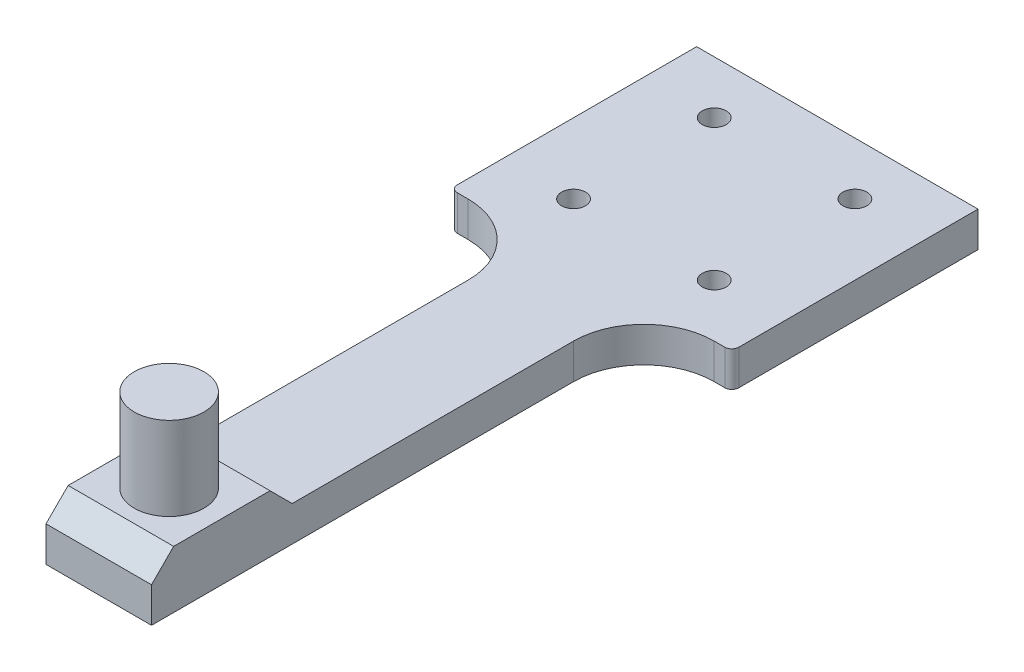
ISO-10303-21;
HEADER;
FILE_DESCRIPTION(('STEP AP214'),'2;1');
FILE_NAME('part.step','',(''),(''),'','','');
FILE_SCHEMA(('AUTOMOTIVE_DESIGN { 1 0 10303 214 1 1 1 1 }'));
ENDSEC;
DATA;
#1=APPLICATION_CONTEXT('core data for automotive mechanical design processes');
#2=APPLICATION_PROTOCOL_DEFINITION('international standard','automotive_design',2000,#1);
#3=PRODUCT_CONTEXT('',#1,'mechanical');
#4=PRODUCT('Part','Part','',(#3));
#5=PRODUCT_RELATED_PRODUCT_CATEGORY('part','',(#4));
#6=PRODUCT_DEFINITION_FORMATION('','',#4);
#7=PRODUCT_DEFINITION_CONTEXT('part definition',#1,'design');
#8=PRODUCT_DEFINITION('design','',#6,#7);
#9=PRODUCT_DEFINITION_SHAPE('','',#8);
#10=(LENGTH_UNIT() NAMED_UNIT(*) SI_UNIT(.MILLI.,.METRE.));
#11=(NAMED_UNIT(*) PLANE_ANGLE_UNIT() SI_UNIT($,.RADIAN.));
#12=(NAMED_UNIT(*) SI_UNIT($,.STERADIAN.) SOLID_ANGLE_UNIT());
#13=UNCERTAINTY_MEASURE_WITH_UNIT(LENGTH_MEASURE(1.E-05),#10,'distance_accuracy_value','');
#14=(GEOMETRIC_REPRESENTATION_CONTEXT(3) GLOBAL_UNCERTAINTY_ASSIGNED_CONTEXT((#13)) GLOBAL_UNIT_ASSIGNED_CONTEXT((#10,
#11,#12)) REPRESENTATION_CONTEXT('',''));
#15=CARTESIAN_POINT('',(0.,0.,0.));
#16=DIRECTION('',(0.,0.,1.));
#17=DIRECTION('',(1.,0.,0.));
#18=AXIS2_PLACEMENT_3D('',#15,#16,#17);
#19=CARTESIAN_POINT('',(0.,5.,0.));
#20=DIRECTION('',(0.,1.,0.));
#21=DIRECTION('',(0.,0.,1.));
#22=AXIS2_PLACEMENT_3D('',#19,#20,#21);
#23=PLANE('',#22);
#24=CARTESIAN_POINT('',(10.,5.,-10.));
#25=DIRECTION('',(0.,1.,0.));
#26=DIRECTION('',(0.,0.,1.));
#27=AXIS2_PLACEMENT_3D('',#24,#25,#26);
#28=CIRCLE('',#27,1.7);
#29=CARTESIAN_POINT('',(10.,5.,-8.3));
#30=VERTEX_POINT('',#29);
#31=EDGE_CURVE('E205',#30,#30,#28,.T.);
#32=ORIENTED_EDGE('',*,*,#31,.F.);
#33=EDGE_LOOP('',(#32));
#34=FACE_BOUND('',#33,.T.);
#35=CARTESIAN_POINT('',(-10.,5.,10.));
#36=DIRECTION('',(0.,1.,0.));
#37=DIRECTION('',(0.,0.,1.));
#38=AXIS2_PLACEMENT_3D('',#35,#36,#37);
#39=CIRCLE('',#38,1.7);
#40=CARTESIAN_POINT('',(-10.,5.,11.7));
#41=VERTEX_POINT('',#40);
#42=EDGE_CURVE('E199',#41,#41,#39,.T.);
#43=ORIENTED_EDGE('',*,*,#42,.F.);
#44=EDGE_LOOP('',(#43));
#45=FACE_BOUND('',#44,.T.);
#46=CARTESIAN_POINT('',(-10.,5.,-10.));
#47=DIRECTION('',(0.,1.,0.));
#48=DIRECTION('',(0.,0.,1.));
#49=AXIS2_PLACEMENT_3D('',#46,#47,#48);
#50=CIRCLE('',#49,1.7);
#51=CARTESIAN_POINT('',(-10.,5.,-8.3));
#52=VERTEX_POINT('',#51);
#53=EDGE_CURVE('E193',#52,#52,#50,.T.);
#54=ORIENTED_EDGE('',*,*,#53,.F.);
#55=EDGE_LOOP('',(#54));
#56=FACE_BOUND('',#55,.T.);
#57=CARTESIAN_POINT('',(10.,5.,10.));
#58=DIRECTION('',(0.,1.,0.));
#59=DIRECTION('',(0.,0.,1.));
#60=AXIS2_PLACEMENT_3D('',#57,#58,#59);
#61=CIRCLE('',#60,1.7);
#62=CARTESIAN_POINT('',(10.,5.,11.7));
#63=VERTEX_POINT('',#62);
#64=EDGE_CURVE('E186',#63,#63,#61,.T.);
#65=ORIENTED_EDGE('',*,*,#64,.F.);
#66=EDGE_LOOP('',(#65));
#67=FACE_BOUND('',#66,.T.);
#68=DIRECTION('',(0.,0.,1.));
#69=VECTOR('',#68,1.);
#70=CARTESIAN_POINT('',(-7.5,5.,17.5));
#71=LINE('',#70,#69);
#72=CARTESIAN_POINT('',(-7.5,5.,27.5));
#73=VERTEX_POINT('',#72);
#74=CARTESIAN_POINT('',(-7.50000000000001,5.,67.5));
#75=VERTEX_POINT('',#74);
#76=EDGE_CURVE('E180',#73,#75,#71,.T.);
#77=ORIENTED_EDGE('',*,*,#76,.T.);
#78=DIRECTION('',(1.,0.,0.));
#79=VECTOR('',#78,1.);
#80=CARTESIAN_POINT('',(0.,5.,67.5));
#81=LINE('',#80,#79);
#82=CARTESIAN_POINT('',(7.50000000000001,5.,67.5));
#83=VERTEX_POINT('',#82);
#84=EDGE_CURVE('E275',#75,#83,#81,.T.);
#85=ORIENTED_EDGE('',*,*,#84,.T.);
#86=DIRECTION('',(0.,0.,-1.));
#87=VECTOR('',#86,1.);
#88=CARTESIAN_POINT('',(7.5,5.,17.5));
#89=LINE('',#88,#87);
#90=CARTESIAN_POINT('',(7.5,5.,27.5));
#91=VERTEX_POINT('',#90);
#92=EDGE_CURVE('E161',#83,#91,#89,.T.);
#93=ORIENTED_EDGE('',*,*,#92,.T.);
#94=CARTESIAN_POINT('',(17.5,5.,27.5));
#95=DIRECTION('',(0.,1.,0.));
#96=DIRECTION('',(0.,0.,1.));
#97=AXIS2_PLACEMENT_3D('',#94,#95,#96);
#98=CIRCLE('',#97,10.);
#99=CARTESIAN_POINT('',(17.5,5.,17.5));
#100=VERTEX_POINT('',#99);
#101=EDGE_CURVE('E249',#91,#100,#98,.F.);
#102=ORIENTED_EDGE('',*,*,#101,.T.);
#103=DIRECTION('',(1.,0.,0.));
#104=VECTOR('',#103,1.);
#105=CARTESIAN_POINT('',(-20.,5.,17.5));
#106=LINE('',#105,#104);
#107=CARTESIAN_POINT('',(19.,5.,17.5));
#108=VERTEX_POINT('',#107);
#109=EDGE_CURVE('E220',#100,#108,#106,.T.);
#110=ORIENTED_EDGE('',*,*,#109,.T.);
#111=CARTESIAN_POINT('',(19.,5.,16.5));
#112=DIRECTION('',(0.,1.,0.));
#113=DIRECTION('',(0.,0.,1.));
#114=AXIS2_PLACEMENT_3D('',#111,#112,#113);
#115=CIRCLE('',#114,1.);
#116=CARTESIAN_POINT('',(20.,5.,16.5));
#117=VERTEX_POINT('',#116);
#118=EDGE_CURVE('E268',#108,#117,#115,.T.);
#119=ORIENTED_EDGE('',*,*,#118,.T.);
#120=DIRECTION('',(0.,0.,-1.));
#121=VECTOR('',#120,1.);
#122=CARTESIAN_POINT('',(20.,5.,-17.5));
#123=LINE('',#122,#121);
#124=CARTESIAN_POINT('',(20.,5.,-17.5));
#125=VERTEX_POINT('',#124);
#126=EDGE_CURVE('E212',#117,#125,#123,.T.);
#127=ORIENTED_EDGE('',*,*,#126,.T.);
#128=DIRECTION('',(-1.,0.,0.));
#129=VECTOR('',#128,1.);
#130=CARTESIAN_POINT('',(-20.,5.,-17.5));
#131=LINE('',#130,#129);
#132=CARTESIAN_POINT('',(-20.,5.,-17.5));
#133=VERTEX_POINT('',#132);
#134=EDGE_CURVE('E214',#125,#133,#131,.T.);
#135=ORIENTED_EDGE('',*,*,#134,.T.);
#136=DIRECTION('',(0.,0.,1.));
#137=VECTOR('',#136,1.);
#138=CARTESIAN_POINT('',(-20.,5.,-17.5));
#139=LINE('',#138,#137);
#140=CARTESIAN_POINT('',(-20.,5.,16.5));
#141=VERTEX_POINT('',#140);
#142=EDGE_CURVE('E217',#133,#141,#139,.T.);
#143=ORIENTED_EDGE('',*,*,#142,.T.);
#144=CARTESIAN_POINT('',(-19.,5.,16.5));
#145=DIRECTION('',(0.,1.,0.));
#146=DIRECTION('',(0.,0.,1.));
#147=AXIS2_PLACEMENT_3D('',#144,#145,#146);
#148=CIRCLE('',#147,1.);
#149=CARTESIAN_POINT('',(-19.,5.,17.5));
#150=VERTEX_POINT('',#149);
#151=EDGE_CURVE('E266',#141,#150,#148,.T.);
#152=ORIENTED_EDGE('',*,*,#151,.T.);
#153=CARTESIAN_POINT('',(-17.5,5.,17.5));
#154=VERTEX_POINT('',#153);
#155=EDGE_CURVE('E221',#150,#154,#106,.T.);
#156=ORIENTED_EDGE('',*,*,#155,.T.);
#157=CARTESIAN_POINT('',(-17.5,5.,27.5));
#158=DIRECTION('',(0.,1.,0.));
#159=DIRECTION('',(0.,0.,1.));
#160=AXIS2_PLACEMENT_3D('',#157,#158,#159);
#161=CIRCLE('',#160,10.);
#162=EDGE_CURVE('E253',#154,#73,#161,.F.);
#163=ORIENTED_EDGE('',*,*,#162,.T.);
#164=EDGE_LOOP('',(#77,#85,#93,#102,#110,#119,#127,#135,#143,#152,#156,#163));
#165=FACE_BOUND('',#164,.T.);
#166=ADVANCED_FACE('F41',(#34,#45,#56,#67,#165),#23,.T.);
#167=CARTESIAN_POINT('',(-20.,5.,17.5));
#168=DIRECTION('',(0.,0.,-1.));
#169=DIRECTION('',(-1.,0.,0.));
#170=AXIS2_PLACEMENT_3D('',#167,#168,#169);
#171=PLANE('',#170);
#172=DIRECTION('',(1.,0.,0.));
#173=VECTOR('',#172,1.);
#174=CARTESIAN_POINT('',(-20.,0.,17.5));
#175=LINE('',#174,#173);
#176=CARTESIAN_POINT('',(17.5,0.,17.5));
#177=VERTEX_POINT('',#176);
#178=CARTESIAN_POINT('',(19.,0.,17.5));
#179=VERTEX_POINT('',#178);
#180=EDGE_CURVE('E230',#177,#179,#175,.T.);
#181=ORIENTED_EDGE('',*,*,#180,.T.);
#182=DIRECTION('',(0.,-1.,0.));
#183=VECTOR('',#182,1.);
#184=CARTESIAN_POINT('',(19.,5.,17.5));
#185=LINE('',#184,#183);
#186=EDGE_CURVE('E264',#179,#108,#185,.F.);
#187=ORIENTED_EDGE('',*,*,#186,.T.);
#188=ORIENTED_EDGE('',*,*,#109,.F.);
#189=DIRECTION('',(0.,1.,0.));
#190=VECTOR('',#189,1.);
#191=CARTESIAN_POINT('',(17.5,5.,17.5));
#192=LINE('',#191,#190);
#193=EDGE_CURVE('E243',#100,#177,#192,.F.);
#194=ORIENTED_EDGE('',*,*,#193,.T.);
#195=EDGE_LOOP('',(#181,#187,#188,#194));
#196=FACE_BOUND('',#195,.T.);
#197=ADVANCED_FACE('F309',(#196),#171,.F.);
#198=CARTESIAN_POINT('',(20.,5.,-17.5));
#199=DIRECTION('',(-1.,0.,0.));
#200=DIRECTION('',(0.,0.,1.));
#201=AXIS2_PLACEMENT_3D('',#198,#199,#200);
#202=PLANE('',#201);
#203=ORIENTED_EDGE('',*,*,#126,.F.);
#204=DIRECTION('',(0.,-1.,0.));
#205=VECTOR('',#204,1.);
#206=CARTESIAN_POINT('',(20.,5.,16.5));
#207=LINE('',#206,#205);
#208=CARTESIAN_POINT('',(20.,0.,16.5));
#209=VERTEX_POINT('',#208);
#210=EDGE_CURVE('E257',#117,#209,#207,.T.);
#211=ORIENTED_EDGE('',*,*,#210,.T.);
#212=DIRECTION('',(0.,0.,-1.));
#213=VECTOR('',#212,1.);
#214=CARTESIAN_POINT('',(20.,0.,-17.5));
#215=LINE('',#214,#213);
#216=CARTESIAN_POINT('',(20.,0.,-17.5));
#217=VERTEX_POINT('',#216);
#218=EDGE_CURVE('E211',#209,#217,#215,.T.);
#219=ORIENTED_EDGE('',*,*,#218,.T.);
#220=DIRECTION('',(0.,-1.,0.));
#221=VECTOR('',#220,1.);
#222=CARTESIAN_POINT('',(20.,5.,-17.5));
#223=LINE('',#222,#221);
#224=EDGE_CURVE('E234',#125,#217,#223,.T.);
#225=ORIENTED_EDGE('',*,*,#224,.F.);
#226=EDGE_LOOP('',(#203,#211,#219,#225));
#227=FACE_BOUND('',#226,.T.);
#228=ADVANCED_FACE('F319',(#227),#202,.F.);
#229=CARTESIAN_POINT('',(-20.,5.,-17.5));
#230=DIRECTION('',(0.,0.,1.));
#231=DIRECTION('',(1.,0.,0.));
#232=AXIS2_PLACEMENT_3D('',#229,#230,#231);
#233=PLANE('',#232);
#234=DIRECTION('',(-1.,0.,0.));
#235=VECTOR('',#234,1.);
#236=CARTESIAN_POINT('',(-20.,0.,-17.5));
#237=LINE('',#236,#235);
#238=CARTESIAN_POINT('',(-20.,0.,-17.5));
#239=VERTEX_POINT('',#238);
#240=EDGE_CURVE('E225',#217,#239,#237,.T.);
#241=ORIENTED_EDGE('',*,*,#240,.T.);
#242=DIRECTION('',(0.,-1.,0.));
#243=VECTOR('',#242,1.);
#244=CARTESIAN_POINT('',(-20.,5.,-17.5));
#245=LINE('',#244,#243);
#246=EDGE_CURVE('E223',#133,#239,#245,.T.);
#247=ORIENTED_EDGE('',*,*,#246,.F.);
#248=ORIENTED_EDGE('',*,*,#134,.F.);
#249=ORIENTED_EDGE('',*,*,#224,.T.);
#250=EDGE_LOOP('',(#241,#247,#248,#249));
#251=FACE_BOUND('',#250,.T.);
#252=ADVANCED_FACE('F322',(#251),#233,.F.);
#253=CARTESIAN_POINT('',(-20.,5.,-17.5));
#254=DIRECTION('',(1.,0.,0.));
#255=DIRECTION('',(0.,0.,-1.));
#256=AXIS2_PLACEMENT_3D('',#253,#254,#255);
#257=PLANE('',#256);
#258=DIRECTION('',(0.,0.,1.));
#259=VECTOR('',#258,1.);
#260=CARTESIAN_POINT('',(-20.,0.,-17.5));
#261=LINE('',#260,#259);
#262=CARTESIAN_POINT('',(-20.,0.,16.5));
#263=VERTEX_POINT('',#262);
#264=EDGE_CURVE('E227',#239,#263,#261,.T.);
#265=ORIENTED_EDGE('',*,*,#264,.T.);
#266=DIRECTION('',(0.,-1.,0.));
#267=VECTOR('',#266,1.);
#268=CARTESIAN_POINT('',(-20.,5.,16.5));
#269=LINE('',#268,#267);
#270=EDGE_CURVE('E273',#263,#141,#269,.F.);
#271=ORIENTED_EDGE('',*,*,#270,.T.);
#272=ORIENTED_EDGE('',*,*,#142,.F.);
#273=ORIENTED_EDGE('',*,*,#246,.T.);
#274=EDGE_LOOP('',(#265,#271,#272,#273));
#275=FACE_BOUND('',#274,.T.);
#276=ADVANCED_FACE('F368',(#275),#257,.F.);
#277=ORIENTED_EDGE('',*,*,#155,.F.);
#278=DIRECTION('',(0.,-1.,0.));
#279=VECTOR('',#278,1.);
#280=CARTESIAN_POINT('',(-19.,5.,17.5));
#281=LINE('',#280,#279);
#282=CARTESIAN_POINT('',(-19.,0.,17.5));
#283=VERTEX_POINT('',#282);
#284=EDGE_CURVE('E270',#150,#283,#281,.T.);
#285=ORIENTED_EDGE('',*,*,#284,.T.);
#286=CARTESIAN_POINT('',(-17.5,0.,17.5));
#287=VERTEX_POINT('',#286);
#288=EDGE_CURVE('E215',#283,#287,#175,.T.);
#289=ORIENTED_EDGE('',*,*,#288,.T.);
#290=DIRECTION('',(0.,1.,0.));
#291=VECTOR('',#290,1.);
#292=CARTESIAN_POINT('',(-17.5,5.,17.5));
#293=LINE('',#292,#291);
#294=EDGE_CURVE('E245',#287,#154,#293,.T.);
#295=ORIENTED_EDGE('',*,*,#294,.T.);
#296=EDGE_LOOP('',(#277,#285,#289,#295));
#297=FACE_BOUND('',#296,.T.);
#298=ADVANCED_FACE('F334',(#297),#171,.F.);
#299=CARTESIAN_POINT('',(0.,0.,0.));
#300=DIRECTION('',(0.,1.,0.));
#301=DIRECTION('',(0.,0.,1.));
#302=AXIS2_PLACEMENT_3D('',#299,#300,#301);
#303=PLANE('',#302);
#304=CARTESIAN_POINT('',(10.,0.,10.));
#305=DIRECTION('',(0.,1.,0.));
#306=DIRECTION('',(0.,0.,1.));
#307=AXIS2_PLACEMENT_3D('',#304,#305,#306);
#308=CIRCLE('',#307,1.7);
#309=CARTESIAN_POINT('',(10.,0.,11.7));
#310=VERTEX_POINT('',#309);
#311=EDGE_CURVE('E190',#310,#310,#308,.T.);
#312=ORIENTED_EDGE('',*,*,#311,.T.);
#313=EDGE_LOOP('',(#312));
#314=FACE_BOUND('',#313,.T.);
#315=CARTESIAN_POINT('',(-10.,0.,-10.));
#316=DIRECTION('',(0.,1.,0.));
#317=DIRECTION('',(0.,0.,1.));
#318=AXIS2_PLACEMENT_3D('',#315,#316,#317);
#319=CIRCLE('',#318,1.7);
#320=CARTESIAN_POINT('',(-10.,0.,-8.3));
#321=VERTEX_POINT('',#320);
#322=EDGE_CURVE('E196',#321,#321,#319,.T.);
#323=ORIENTED_EDGE('',*,*,#322,.T.);
#324=EDGE_LOOP('',(#323));
#325=FACE_BOUND('',#324,.T.);
#326=CARTESIAN_POINT('',(-10.,0.,10.));
#327=DIRECTION('',(0.,1.,0.));
#328=DIRECTION('',(0.,0.,1.));
#329=AXIS2_PLACEMENT_3D('',#326,#327,#328);
#330=CIRCLE('',#329,1.7);
#331=CARTESIAN_POINT('',(-10.,0.,11.7));
#332=VERTEX_POINT('',#331);
#333=EDGE_CURVE('E202',#332,#332,#330,.T.);
#334=ORIENTED_EDGE('',*,*,#333,.T.);
#335=EDGE_LOOP('',(#334));
#336=FACE_BOUND('',#335,.T.);
#337=CARTESIAN_POINT('',(10.,0.,-10.));
#338=DIRECTION('',(0.,1.,0.));
#339=DIRECTION('',(0.,0.,1.));
#340=AXIS2_PLACEMENT_3D('',#337,#338,#339);
#341=CIRCLE('',#340,1.7);
#342=CARTESIAN_POINT('',(10.,0.,-8.3));
#343=VERTEX_POINT('',#342);
#344=EDGE_CURVE('E208',#343,#343,#341,.T.);
#345=ORIENTED_EDGE('',*,*,#344,.T.);
#346=EDGE_LOOP('',(#345));
#347=FACE_BOUND('',#346,.T.);
#348=ORIENTED_EDGE('',*,*,#218,.F.);
#349=CARTESIAN_POINT('',(19.,0.,16.5));
#350=DIRECTION('',(0.,1.,0.));
#351=DIRECTION('',(0.,0.,1.));
#352=AXIS2_PLACEMENT_3D('',#349,#350,#351);
#353=CIRCLE('',#352,1.);
#354=EDGE_CURVE('E262',#209,#179,#353,.F.);
#355=ORIENTED_EDGE('',*,*,#354,.T.);
#356=ORIENTED_EDGE('',*,*,#180,.F.);
#357=CARTESIAN_POINT('',(17.5,0.,27.5));
#358=DIRECTION('',(0.,1.,0.));
#359=DIRECTION('',(0.,0.,1.));
#360=AXIS2_PLACEMENT_3D('',#357,#358,#359);
#361=CIRCLE('',#360,10.);
#362=CARTESIAN_POINT('',(7.5,0.,27.5));
#363=VERTEX_POINT('',#362);
#364=EDGE_CURVE('E251',#177,#363,#361,.T.);
#365=ORIENTED_EDGE('',*,*,#364,.T.);
#366=DIRECTION('',(0.,0.,-1.));
#367=VECTOR('',#366,1.);
#368=CARTESIAN_POINT('',(7.5,0.,17.5));
#369=LINE('',#368,#367);
#370=CARTESIAN_POINT('',(7.50000000000001,0.,87.5));
#371=VERTEX_POINT('',#370);
#372=EDGE_CURVE('E170',#371,#363,#369,.T.);
#373=ORIENTED_EDGE('',*,*,#372,.F.);
#374=DIRECTION('',(1.,0.,0.));
#375=VECTOR('',#374,1.);
#376=CARTESIAN_POINT('',(-7.50000000000001,0.,87.5));
#377=LINE('',#376,#375);
#378=CARTESIAN_POINT('',(-7.50000000000001,0.,87.5));
#379=VERTEX_POINT('',#378);
#380=EDGE_CURVE('E160',#379,#371,#377,.T.);
#381=ORIENTED_EDGE('',*,*,#380,.F.);
#382=DIRECTION('',(0.,0.,1.));
#383=VECTOR('',#382,1.);
#384=CARTESIAN_POINT('',(-7.5,0.,17.5));
#385=LINE('',#384,#383);
#386=CARTESIAN_POINT('',(-7.5,0.,27.5));
#387=VERTEX_POINT('',#386);
#388=EDGE_CURVE('E148',#387,#379,#385,.T.);
#389=ORIENTED_EDGE('',*,*,#388,.F.);
#390=CARTESIAN_POINT('',(-17.5,0.,27.5));
#391=DIRECTION('',(0.,1.,0.));
#392=DIRECTION('',(0.,0.,1.));
#393=AXIS2_PLACEMENT_3D('',#390,#391,#392);
#394=CIRCLE('',#393,10.);
#395=EDGE_CURVE('E255',#387,#287,#394,.T.);
#396=ORIENTED_EDGE('',*,*,#395,.T.);
#397=ORIENTED_EDGE('',*,*,#288,.F.);
#398=CARTESIAN_POINT('',(-19.,0.,16.5));
#399=DIRECTION('',(0.,1.,0.));
#400=DIRECTION('',(0.,0.,1.));
#401=AXIS2_PLACEMENT_3D('',#398,#399,#400);
#402=CIRCLE('',#401,1.);
#403=EDGE_CURVE('E260',#283,#263,#402,.F.);
#404=ORIENTED_EDGE('',*,*,#403,.T.);
#405=ORIENTED_EDGE('',*,*,#264,.F.);
#406=ORIENTED_EDGE('',*,*,#240,.F.);
#407=EDGE_LOOP('',(#348,#355,#356,#365,#373,#381,#389,#396,#397,#404,#405,#406));
#408=FACE_BOUND('',#407,.T.);
#409=ADVANCED_FACE('F174',(#314,#325,#336,#347,#408),#303,.F.);
#410=CARTESIAN_POINT('',(10.,5.,-10.));
#411=DIRECTION('',(0.,1.,0.));
#412=DIRECTION('',(0.,0.,1.));
#413=AXIS2_PLACEMENT_3D('',#410,#411,#412);
#414=CYLINDRICAL_SURFACE('',#413,1.7);
#415=ORIENTED_EDGE('',*,*,#344,.F.);
#416=EDGE_LOOP('',(#415));
#417=FACE_BOUND('',#416,.T.);
#418=ORIENTED_EDGE('',*,*,#31,.T.);
#419=EDGE_LOOP('',(#418));
#420=FACE_BOUND('',#419,.T.);
#421=ADVANCED_FACE('F362',(#417,#420),#414,.F.);
#422=CARTESIAN_POINT('',(-10.,5.,10.));
#423=DIRECTION('',(0.,1.,0.));
#424=DIRECTION('',(0.,0.,1.));
#425=AXIS2_PLACEMENT_3D('',#422,#423,#424);
#426=CYLINDRICAL_SURFACE('',#425,1.7);
#427=ORIENTED_EDGE('',*,*,#333,.F.);
#428=EDGE_LOOP('',(#427));
#429=FACE_BOUND('',#428,.T.);
#430=ORIENTED_EDGE('',*,*,#42,.T.);
#431=EDGE_LOOP('',(#430));
#432=FACE_BOUND('',#431,.T.);
#433=ADVANCED_FACE('F503',(#429,#432),#426,.F.);
#434=CARTESIAN_POINT('',(-10.,5.,-10.));
#435=DIRECTION('',(0.,1.,0.));
#436=DIRECTION('',(0.,0.,1.));
#437=AXIS2_PLACEMENT_3D('',#434,#435,#436);
#438=CYLINDRICAL_SURFACE('',#437,1.7);
#439=ORIENTED_EDGE('',*,*,#322,.F.);
#440=EDGE_LOOP('',(#439));
#441=FACE_BOUND('',#440,.T.);
#442=ORIENTED_EDGE('',*,*,#53,.T.);
#443=EDGE_LOOP('',(#442));
#444=FACE_BOUND('',#443,.T.);
#445=ADVANCED_FACE('F494',(#441,#444),#438,.F.);
#446=CARTESIAN_POINT('',(10.,5.,10.));
#447=DIRECTION('',(0.,1.,0.));
#448=DIRECTION('',(0.,0.,1.));
#449=AXIS2_PLACEMENT_3D('',#446,#447,#448);
#450=CYLINDRICAL_SURFACE('',#449,1.7);
#451=ORIENTED_EDGE('',*,*,#311,.F.);
#452=EDGE_LOOP('',(#451));
#453=FACE_BOUND('',#452,.T.);
#454=ORIENTED_EDGE('',*,*,#64,.T.);
#455=EDGE_LOOP('',(#454));
#456=FACE_BOUND('',#455,.T.);
#457=ADVANCED_FACE('F451',(#453,#456),#450,.F.);
#458=CARTESIAN_POINT('',(-7.5,0.,17.5));
#459=DIRECTION('',(-1.,0.,0.));
#460=DIRECTION('',(0.,0.,1.));
#461=AXIS2_PLACEMENT_3D('',#458,#459,#460);
#462=PLANE('',#461);
#463=ORIENTED_EDGE('',*,*,#76,.F.);
#464=DIRECTION('',(0.,1.,0.));
#465=VECTOR('',#464,1.);
#466=CARTESIAN_POINT('',(-7.5,0.,27.5));
#467=LINE('',#466,#465);
#468=EDGE_CURVE('E155',#73,#387,#467,.F.);
#469=ORIENTED_EDGE('',*,*,#468,.T.);
#470=ORIENTED_EDGE('',*,*,#388,.T.);
#471=DIRECTION('',(0.,1.,0.));
#472=VECTOR('',#471,1.);
#473=CARTESIAN_POINT('',(-7.50000000000001,0.,87.5));
#474=LINE('',#473,#472);
#475=CARTESIAN_POINT('',(-7.50000000000001,5.,87.5));
#476=VERTEX_POINT('',#475);
#477=EDGE_CURVE('E152',#379,#476,#474,.T.);
#478=ORIENTED_EDGE('',*,*,#477,.T.);
#479=DIRECTION('',(0.,0.707106781186551,-0.707106781186544));
#480=VECTOR('',#479,1.);
#481=CARTESIAN_POINT('',(-7.50000000000001,9.00000000000007,83.5));
#482=LINE('',#481,#480);
#483=CARTESIAN_POINT('',(-7.50000000000001,8.15,84.3500000000001));
#484=VERTEX_POINT('',#483);
#485=EDGE_CURVE('E11',#476,#484,#482,.T.);
#486=ORIENTED_EDGE('',*,*,#485,.T.);
#487=DIRECTION('',(0.,0.,1.));
#488=VECTOR('',#487,1.);
#489=CARTESIAN_POINT('',(-7.50000000000001,8.15,83.5));
#490=LINE('',#489,#488);
#491=CARTESIAN_POINT('',(-7.50000000000001,8.15,70.6499999999999));
#492=VERTEX_POINT('',#491);
#493=EDGE_CURVE('E57',#492,#484,#490,.T.);
#494=ORIENTED_EDGE('',*,*,#493,.F.);
#495=DIRECTION('',(0.,-0.707106781186551,-0.707106781186544));
#496=VECTOR('',#495,1.);
#497=CARTESIAN_POINT('',(-7.50000000000001,9.00000000000007,71.5));
#498=LINE('',#497,#496);
#499=EDGE_CURVE('E280',#492,#75,#498,.T.);
#500=ORIENTED_EDGE('',*,*,#499,.T.);
#501=EDGE_LOOP('',(#463,#469,#470,#478,#486,#494,#500));
#502=FACE_BOUND('',#501,.T.);
#503=ADVANCED_FACE('F151',(#502),#462,.T.);
#504=CARTESIAN_POINT('',(7.5,0.,17.5));
#505=DIRECTION('',(1.,0.,0.));
#506=DIRECTION('',(0.,0.,-1.));
#507=AXIS2_PLACEMENT_3D('',#504,#505,#506);
#508=PLANE('',#507);
#509=ORIENTED_EDGE('',*,*,#372,.T.);
#510=DIRECTION('',(0.,1.,0.));
#511=VECTOR('',#510,1.);
#512=CARTESIAN_POINT('',(7.5,0.,27.5));
#513=LINE('',#512,#511);
#514=EDGE_CURVE('E240',#363,#91,#513,.T.);
#515=ORIENTED_EDGE('',*,*,#514,.T.);
#516=ORIENTED_EDGE('',*,*,#92,.F.);
#517=DIRECTION('',(0.,0.707106781186551,0.707106781186544));
#518=VECTOR('',#517,1.);
#519=CARTESIAN_POINT('',(7.50000000000001,9.00000000000007,71.5));
#520=LINE('',#519,#518);
#521=CARTESIAN_POINT('',(7.50000000000001,8.15,70.6499999999999));
#522=VERTEX_POINT('',#521);
#523=EDGE_CURVE('E282',#83,#522,#520,.T.);
#524=ORIENTED_EDGE('',*,*,#523,.T.);
#525=DIRECTION('',(0.,0.,-1.));
#526=VECTOR('',#525,1.);
#527=CARTESIAN_POINT('',(7.50000000000001,8.15,83.5));
#528=LINE('',#527,#526);
#529=CARTESIAN_POINT('',(7.50000000000001,8.15,84.3500000000001));
#530=VERTEX_POINT('',#529);
#531=EDGE_CURVE('E65',#530,#522,#528,.T.);
#532=ORIENTED_EDGE('',*,*,#531,.F.);
#533=DIRECTION('',(0.,-0.707106781186551,0.707106781186544));
#534=VECTOR('',#533,1.);
#535=CARTESIAN_POINT('',(7.50000000000001,9.00000000000007,83.5));
#536=LINE('',#535,#534);
#537=CARTESIAN_POINT('',(7.50000000000001,5.,87.5));
#538=VERTEX_POINT('',#537);
#539=EDGE_CURVE('E50',#530,#538,#536,.T.);
#540=ORIENTED_EDGE('',*,*,#539,.T.);
#541=DIRECTION('',(0.,1.,0.));
#542=VECTOR('',#541,1.);
#543=CARTESIAN_POINT('',(7.50000000000001,0.,87.5));
#544=LINE('',#543,#542);
#545=EDGE_CURVE('E169',#371,#538,#544,.T.);
#546=ORIENTED_EDGE('',*,*,#545,.F.);
#547=EDGE_LOOP('',(#509,#515,#516,#524,#532,#540,#546));
#548=FACE_BOUND('',#547,.T.);
#549=ADVANCED_FACE('F286',(#548),#508,.T.);
#550=CARTESIAN_POINT('',(-7.50000000000001,0.,87.5));
#551=DIRECTION('',(0.,0.,1.));
#552=DIRECTION('',(1.,0.,0.));
#553=AXIS2_PLACEMENT_3D('',#550,#551,#552);
#554=PLANE('',#553);
#555=DIRECTION('',(1.,0.,0.));
#556=VECTOR('',#555,1.);
#557=CARTESIAN_POINT('',(-7.50000000000001,5.,87.5));
#558=LINE('',#557,#556);
#559=EDGE_CURVE('E168',#476,#538,#558,.T.);
#560=ORIENTED_EDGE('',*,*,#559,.F.);
#561=ORIENTED_EDGE('',*,*,#477,.F.);
#562=ORIENTED_EDGE('',*,*,#380,.T.);
#563=ORIENTED_EDGE('',*,*,#545,.T.);
#564=EDGE_LOOP('',(#560,#561,#562,#563));
#565=FACE_BOUND('',#564,.T.);
#566=ADVANCED_FACE('F165',(#565),#554,.T.);
#567=CARTESIAN_POINT('',(0.,8.15,0.));
#568=DIRECTION('',(0.,-1.,0.));
#569=DIRECTION('',(0.,0.,-1.));
#570=AXIS2_PLACEMENT_3D('',#567,#568,#569);
#571=PLANE('',#570);
#572=CARTESIAN_POINT('',(0.,8.15,77.5));
#573=DIRECTION('',(0.,-1.,0.));
#574=DIRECTION('',(0.,0.,-1.));
#575=AXIS2_PLACEMENT_3D('',#572,#573,#574);
#576=CIRCLE('',#575,4.96);
#577=CARTESIAN_POINT('',(0.,8.15,72.54));
#578=VERTEX_POINT('',#577);
#579=EDGE_CURVE('E237',#578,#578,#576,.T.);
#580=ORIENTED_EDGE('',*,*,#579,.T.);
#581=EDGE_LOOP('',(#580));
#582=FACE_BOUND('',#581,.T.);
#583=ORIENTED_EDGE('',*,*,#531,.T.);
#584=DIRECTION('',(-1.,0.,0.));
#585=VECTOR('',#584,1.);
#586=CARTESIAN_POINT('',(0.,8.15,70.6499999999999));
#587=LINE('',#586,#585);
#588=EDGE_CURVE('E278',#522,#492,#587,.T.);
#589=ORIENTED_EDGE('',*,*,#588,.T.);
#590=ORIENTED_EDGE('',*,*,#493,.T.);
#591=DIRECTION('',(1.,0.,0.));
#592=VECTOR('',#591,1.);
#593=CARTESIAN_POINT('',(0.,8.15,84.3500000000001));
#594=LINE('',#593,#592);
#595=EDGE_CURVE('E284',#484,#530,#594,.T.);
#596=ORIENTED_EDGE('',*,*,#595,.T.);
#597=EDGE_LOOP('',(#583,#589,#590,#596));
#598=FACE_BOUND('',#597,.T.);
#599=ADVANCED_FACE('F292',(#582,#598),#571,.F.);
#600=CARTESIAN_POINT('',(0.,20.,77.5));
#601=DIRECTION('',(0.,1.,0.));
#602=DIRECTION('',(0.,0.,1.));
#603=AXIS2_PLACEMENT_3D('',#600,#601,#602);
#604=PLANE('',#603);
#605=CARTESIAN_POINT('',(0.,20.,77.5));
#606=DIRECTION('',(0.,1.,0.));
#607=DIRECTION('',(0.,0.,1.));
#608=AXIS2_PLACEMENT_3D('',#605,#606,#607);
#609=CIRCLE('',#608,4.96);
#610=CARTESIAN_POINT('',(0.,20.,82.46));
#611=VERTEX_POINT('',#610);
#612=EDGE_CURVE('E183',#611,#611,#609,.T.);
#613=ORIENTED_EDGE('',*,*,#612,.T.);
#614=EDGE_LOOP('',(#613));
#615=FACE_BOUND('',#614,.T.);
#616=ADVANCED_FACE('F428',(#615),#604,.T.);
#617=CARTESIAN_POINT('',(0.,20.,77.5));
#618=DIRECTION('',(0.,-1.,0.));
#619=DIRECTION('',(0.,0.,-1.));
#620=AXIS2_PLACEMENT_3D('',#617,#618,#619);
#621=CYLINDRICAL_SURFACE('',#620,4.96);
#622=ORIENTED_EDGE('',*,*,#612,.F.);
#623=EDGE_LOOP('',(#622));
#624=FACE_BOUND('',#623,.T.);
#625=ORIENTED_EDGE('',*,*,#579,.F.);
#626=EDGE_LOOP('',(#625));
#627=FACE_BOUND('',#626,.T.);
#628=ADVANCED_FACE('F348',(#624,#627),#621,.T.);
#629=CARTESIAN_POINT('',(17.5,0.,27.5));
#630=DIRECTION('',(0.,1.,0.));
#631=DIRECTION('',(0.,0.,1.));
#632=AXIS2_PLACEMENT_3D('',#629,#630,#631);
#633=CYLINDRICAL_SURFACE('',#632,10.);
#634=ORIENTED_EDGE('',*,*,#364,.F.);
#635=ORIENTED_EDGE('',*,*,#193,.F.);
#636=ORIENTED_EDGE('',*,*,#101,.F.);
#637=ORIENTED_EDGE('',*,*,#514,.F.);
#638=EDGE_LOOP('',(#634,#635,#636,#637));
#639=FACE_BOUND('',#638,.T.);
#640=ADVANCED_FACE('F302',(#639),#633,.F.);
#641=CARTESIAN_POINT('',(-17.5,5.,27.5));
#642=DIRECTION('',(0.,1.,0.));
#643=DIRECTION('',(0.,0.,1.));
#644=AXIS2_PLACEMENT_3D('',#641,#642,#643);
#645=CYLINDRICAL_SURFACE('',#644,10.);
#646=ORIENTED_EDGE('',*,*,#395,.F.);
#647=ORIENTED_EDGE('',*,*,#468,.F.);
#648=ORIENTED_EDGE('',*,*,#162,.F.);
#649=ORIENTED_EDGE('',*,*,#294,.F.);
#650=EDGE_LOOP('',(#646,#647,#648,#649));
#651=FACE_BOUND('',#650,.T.);
#652=ADVANCED_FACE('F339',(#651),#645,.F.);
#653=CARTESIAN_POINT('',(19.,5.,16.5));
#654=DIRECTION('',(0.,-1.,0.));
#655=DIRECTION('',(0.,0.,-1.));
#656=AXIS2_PLACEMENT_3D('',#653,#654,#655);
#657=CYLINDRICAL_SURFACE('',#656,1.);
#658=ORIENTED_EDGE('',*,*,#118,.F.);
#659=ORIENTED_EDGE('',*,*,#186,.F.);
#660=ORIENTED_EDGE('',*,*,#354,.F.);
#661=ORIENTED_EDGE('',*,*,#210,.F.);
#662=EDGE_LOOP('',(#658,#659,#660,#661));
#663=FACE_BOUND('',#662,.T.);
#664=ADVANCED_FACE('F313',(#663),#657,.T.);
#665=CARTESIAN_POINT('',(-19.,5.,16.5));
#666=DIRECTION('',(0.,-1.,0.));
#667=DIRECTION('',(0.,0.,-1.));
#668=AXIS2_PLACEMENT_3D('',#665,#666,#667);
#669=CYLINDRICAL_SURFACE('',#668,1.);
#670=ORIENTED_EDGE('',*,*,#151,.F.);
#671=ORIENTED_EDGE('',*,*,#270,.F.);
#672=ORIENTED_EDGE('',*,*,#403,.F.);
#673=ORIENTED_EDGE('',*,*,#284,.F.);
#674=EDGE_LOOP('',(#670,#671,#672,#673));
#675=FACE_BOUND('',#674,.T.);
#676=ADVANCED_FACE('F331',(#675),#669,.T.);
#677=CARTESIAN_POINT('',(-7.50000000000001,9.00000000000007,71.5));
#678=DIRECTION('',(0.,-0.707106781186544,0.707106781186551));
#679=DIRECTION('',(-1.,0.,0.));
#680=AXIS2_PLACEMENT_3D('',#677,#678,#679);
#681=PLANE('',#680);
#682=ORIENTED_EDGE('',*,*,#523,.F.);
#683=ORIENTED_EDGE('',*,*,#84,.F.);
#684=ORIENTED_EDGE('',*,*,#499,.F.);
#685=ORIENTED_EDGE('',*,*,#588,.F.);
#686=EDGE_LOOP('',(#682,#683,#684,#685));
#687=FACE_BOUND('',#686,.T.);
#688=ADVANCED_FACE('F295',(#687),#681,.F.);
#689=CARTESIAN_POINT('',(-7.50000000000001,9.00000000000007,83.5));
#690=DIRECTION('',(0.,-0.707106781186544,-0.707106781186551));
#691=DIRECTION('',(1.,0.,0.));
#692=AXIS2_PLACEMENT_3D('',#689,#690,#691);
#693=PLANE('',#692);
#694=ORIENTED_EDGE('',*,*,#485,.F.);
#695=ORIENTED_EDGE('',*,*,#559,.T.);
#696=ORIENTED_EDGE('',*,*,#539,.F.);
#697=ORIENTED_EDGE('',*,*,#595,.F.);
#698=EDGE_LOOP('',(#694,#695,#696,#697));
#699=FACE_BOUND('',#698,.T.);
#700=ADVANCED_FACE('F44',(#699),#693,.F.);
#701=CLOSED_SHELL('',(#166,#197,#228,#252,#276,#298,#409,#421,#433,#445,#457,#503,#549,#566,
#599,#616,#628,#640,#652,#664,#676,#688,#700));
#702=MANIFOLD_SOLID_BREP('B2',#701);
#703=ADVANCED_BREP_SHAPE_REPRESENTATION('',(#18,#702),#14);
#704=SHAPE_DEFINITION_REPRESENTATION(#9,#703);
ENDSEC;
END-ISO-10303-21;
